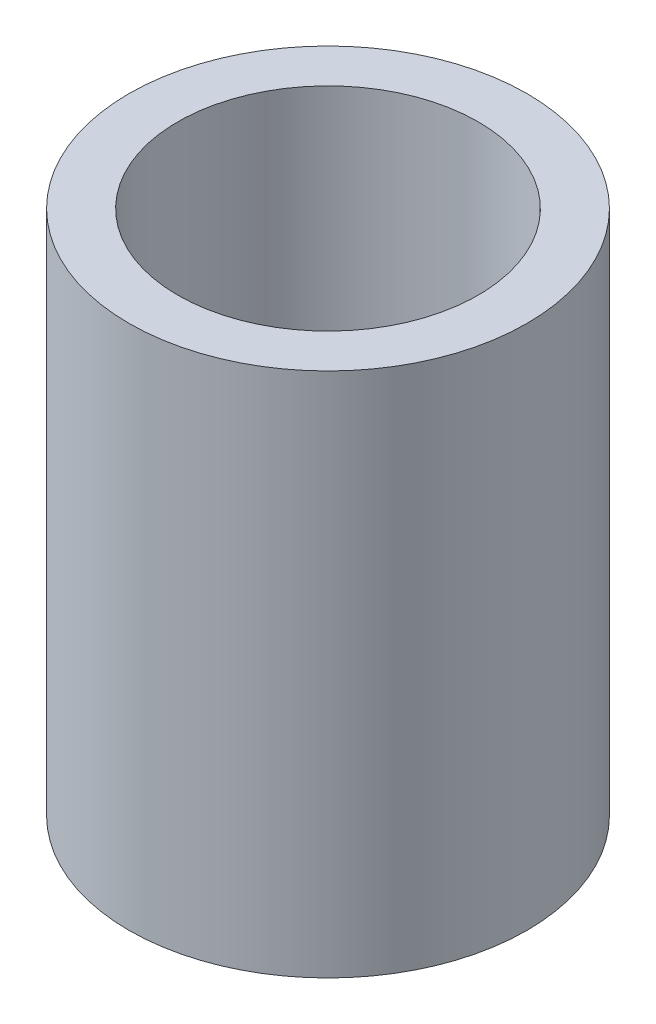
ISO-10303-21;
HEADER;
FILE_DESCRIPTION(('STEP AP214'),'2;1');
FILE_NAME('part.step','',(''),(''),'','','');
FILE_SCHEMA(('AUTOMOTIVE_DESIGN { 1 0 10303 214 1 1 1 1 }'));
ENDSEC;
DATA;
#1=APPLICATION_CONTEXT('core data for automotive mechanical design processes');
#2=APPLICATION_PROTOCOL_DEFINITION('international standard','automotive_design',2000,#1);
#3=PRODUCT_CONTEXT('',#1,'mechanical');
#4=PRODUCT('Part','Part','',(#3));
#5=PRODUCT_RELATED_PRODUCT_CATEGORY('part','',(#4));
#6=PRODUCT_DEFINITION_FORMATION('','',#4);
#7=PRODUCT_DEFINITION_CONTEXT('part definition',#1,'design');
#8=PRODUCT_DEFINITION('design','',#6,#7);
#9=PRODUCT_DEFINITION_SHAPE('','',#8);
#10=(LENGTH_UNIT() NAMED_UNIT(*) SI_UNIT(.MILLI.,.METRE.));
#11=(NAMED_UNIT(*) PLANE_ANGLE_UNIT() SI_UNIT($,.RADIAN.));
#12=(NAMED_UNIT(*) SI_UNIT($,.STERADIAN.) SOLID_ANGLE_UNIT());
#13=UNCERTAINTY_MEASURE_WITH_UNIT(LENGTH_MEASURE(1.E-05),#10,'distance_accuracy_value','');
#14=(GEOMETRIC_REPRESENTATION_CONTEXT(3) GLOBAL_UNCERTAINTY_ASSIGNED_CONTEXT((#13)) GLOBAL_UNIT_ASSIGNED_CONTEXT((#10,
#11,#12)) REPRESENTATION_CONTEXT('',''));
#15=CARTESIAN_POINT('',(0.,0.,0.));
#16=DIRECTION('',(0.,0.,1.));
#17=DIRECTION('',(1.,0.,0.));
#18=AXIS2_PLACEMENT_3D('',#15,#16,#17);
#19=CARTESIAN_POINT('',(0.,35.,0.));
#20=DIRECTION('',(0.,-1.,0.));
#21=DIRECTION('',(0.,0.,-1.));
#22=AXIS2_PLACEMENT_3D('',#19,#20,#21);
#23=CYLINDRICAL_SURFACE('',#22,13.25);
#24=CARTESIAN_POINT('',(0.,35.,0.));
#25=DIRECTION('',(0.,1.,0.));
#26=DIRECTION('',(0.,0.,1.));
#27=AXIS2_PLACEMENT_3D('',#24,#25,#26);
#28=CIRCLE('',#27,13.25);
#29=CARTESIAN_POINT('',(0.,35.,13.25));
#30=VERTEX_POINT('',#29);
#31=EDGE_CURVE('E10',#30,#30,#28,.T.);
#32=ORIENTED_EDGE('',*,*,#31,.F.);
#33=EDGE_LOOP('',(#32));
#34=FACE_BOUND('',#33,.T.);
#35=CARTESIAN_POINT('',(0.,0.,0.));
#36=DIRECTION('',(0.,1.,0.));
#37=DIRECTION('',(0.,0.,1.));
#38=AXIS2_PLACEMENT_3D('',#35,#36,#37);
#39=CIRCLE('',#38,13.25);
#40=CARTESIAN_POINT('',(0.,0.,13.25));
#41=VERTEX_POINT('',#40);
#42=EDGE_CURVE('E44',#41,#41,#39,.T.);
#43=ORIENTED_EDGE('',*,*,#42,.T.);
#44=EDGE_LOOP('',(#43));
#45=FACE_BOUND('',#44,.T.);
#46=ADVANCED_FACE('F41',(#34,#45),#23,.T.);
#47=CARTESIAN_POINT('',(0.,35.,0.));
#48=DIRECTION('',(0.,1.,0.));
#49=DIRECTION('',(0.,0.,1.));
#50=AXIS2_PLACEMENT_3D('',#47,#48,#49);
#51=PLANE('',#50);
#52=CARTESIAN_POINT('',(0.,35.,0.));
#53=DIRECTION('',(0.,1.,0.));
#54=DIRECTION('',(0.,0.,1.));
#55=AXIS2_PLACEMENT_3D('',#52,#53,#54);
#56=CIRCLE('',#55,10.);
#57=CARTESIAN_POINT('',(0.,35.,10.));
#58=VERTEX_POINT('',#57);
#59=EDGE_CURVE('E79',#58,#58,#56,.T.);
#60=ORIENTED_EDGE('',*,*,#59,.F.);
#61=EDGE_LOOP('',(#60));
#62=FACE_BOUND('',#61,.T.);
#63=ORIENTED_EDGE('',*,*,#31,.T.);
#64=EDGE_LOOP('',(#63));
#65=FACE_BOUND('',#64,.T.);
#66=ADVANCED_FACE('F96',(#62,#65),#51,.T.);
#67=CARTESIAN_POINT('',(0.,0.,0.));
#68=DIRECTION('',(0.,1.,0.));
#69=DIRECTION('',(0.,0.,1.));
#70=AXIS2_PLACEMENT_3D('',#67,#68,#69);
#71=PLANE('',#70);
#72=CARTESIAN_POINT('',(0.,0.,0.));
#73=DIRECTION('',(0.,-1.,0.));
#74=DIRECTION('',(0.,0.,-1.));
#75=AXIS2_PLACEMENT_3D('',#72,#73,#74);
#76=CIRCLE('',#75,10.);
#77=CARTESIAN_POINT('',(0.,0.,-10.));
#78=VERTEX_POINT('',#77);
#79=EDGE_CURVE('E55',#78,#78,#76,.T.);
#80=ORIENTED_EDGE('',*,*,#79,.F.);
#81=EDGE_LOOP('',(#80));
#82=FACE_BOUND('',#81,.T.);
#83=ORIENTED_EDGE('',*,*,#42,.F.);
#84=EDGE_LOOP('',(#83));
#85=FACE_BOUND('',#84,.T.);
#86=ADVANCED_FACE('F98',(#82,#85),#71,.F.);
#87=CARTESIAN_POINT('',(0.,8.,0.));
#88=DIRECTION('',(0.,-1.,0.));
#89=DIRECTION('',(0.,0.,-1.));
#90=AXIS2_PLACEMENT_3D('',#87,#88,#89);
#91=CYLINDRICAL_SURFACE('',#90,10.);
#92=CARTESIAN_POINT('',(0.,8.,0.));
#93=DIRECTION('',(0.,-1.,0.));
#94=DIRECTION('',(0.,0.,-1.));
#95=AXIS2_PLACEMENT_3D('',#92,#93,#94);
#96=CIRCLE('',#95,10.);
#97=CARTESIAN_POINT('',(0.,8.,-10.));
#98=VERTEX_POINT('',#97);
#99=EDGE_CURVE('E53',#98,#98,#96,.T.);
#100=ORIENTED_EDGE('',*,*,#99,.F.);
#101=EDGE_LOOP('',(#100));
#102=FACE_BOUND('',#101,.T.);
#103=ORIENTED_EDGE('',*,*,#79,.T.);
#104=EDGE_LOOP('',(#103));
#105=FACE_BOUND('',#104,.T.);
#106=ADVANCED_FACE('F104',(#102,#105),#91,.F.);
#107=CARTESIAN_POINT('',(0.,8.,0.));
#108=DIRECTION('',(0.,-1.,0.));
#109=DIRECTION('',(0.,0.,-1.));
#110=AXIS2_PLACEMENT_3D('',#107,#108,#109);
#111=PLANE('',#110);
#112=CARTESIAN_POINT('',(0.,8.,0.));
#113=DIRECTION('',(0.,-1.,0.));
#114=DIRECTION('',(0.,0.,-1.));
#115=AXIS2_PLACEMENT_3D('',#112,#113,#114);
#116=CIRCLE('',#115,3.48500000000002);
#117=CARTESIAN_POINT('',(0.,8.,-3.48500000000002));
#118=VERTEX_POINT('',#117);
#119=EDGE_CURVE('E63',#118,#118,#116,.T.);
#120=ORIENTED_EDGE('',*,*,#119,.F.);
#121=EDGE_LOOP('',(#120));
#122=FACE_BOUND('',#121,.T.);
#123=ORIENTED_EDGE('',*,*,#99,.T.);
#124=EDGE_LOOP('',(#123));
#125=FACE_BOUND('',#124,.T.);
#126=ADVANCED_FACE('F110',(#122,#125),#111,.T.);
#127=CARTESIAN_POINT('',(0.,4.,0.));
#128=DIRECTION('',(0.,1.,0.));
#129=DIRECTION('',(0.,0.,1.));
#130=AXIS2_PLACEMENT_3D('',#127,#128,#129);
#131=CYLINDRICAL_SURFACE('',#130,3.48500000000002);
#132=CARTESIAN_POINT('',(0.,4.,0.));
#133=DIRECTION('',(0.,-1.,0.));
#134=DIRECTION('',(0.,0.,-1.));
#135=AXIS2_PLACEMENT_3D('',#132,#133,#134);
#136=CIRCLE('',#135,3.48500000000002);
#137=CARTESIAN_POINT('',(0.,4.,-3.48500000000002));
#138=VERTEX_POINT('',#137);
#139=EDGE_CURVE('E59',#138,#138,#136,.T.);
#140=ORIENTED_EDGE('',*,*,#139,.F.);
#141=EDGE_LOOP('',(#140));
#142=FACE_BOUND('',#141,.T.);
#143=ORIENTED_EDGE('',*,*,#119,.T.);
#144=EDGE_LOOP('',(#143));
#145=FACE_BOUND('',#144,.T.);
#146=ADVANCED_FACE('F114',(#142,#145),#131,.T.);
#147=CARTESIAN_POINT('',(0.,4.,0.));
#148=DIRECTION('',(0.,-1.,0.));
#149=DIRECTION('',(0.,0.,-1.));
#150=AXIS2_PLACEMENT_3D('',#147,#148,#149);
#151=PLANE('',#150);
#152=CARTESIAN_POINT('',(0.,4.,0.));
#153=DIRECTION('',(0.,-1.,0.));
#154=DIRECTION('',(0.,0.,-1.));
#155=AXIS2_PLACEMENT_3D('',#152,#153,#154);
#156=CIRCLE('',#155,1.625);
#157=CARTESIAN_POINT('',(0.,4.,-1.625));
#158=VERTEX_POINT('',#157);
#159=EDGE_CURVE('E71',#158,#158,#156,.T.);
#160=ORIENTED_EDGE('',*,*,#159,.F.);
#161=EDGE_LOOP('',(#160));
#162=FACE_BOUND('',#161,.T.);
#163=ORIENTED_EDGE('',*,*,#139,.T.);
#164=EDGE_LOOP('',(#163));
#165=FACE_BOUND('',#164,.T.);
#166=ADVANCED_FACE('F118',(#162,#165),#151,.T.);
#167=CARTESIAN_POINT('',(0.,12.75,0.));
#168=DIRECTION('',(0.,-1.,0.));
#169=DIRECTION('',(0.,0.,-1.));
#170=AXIS2_PLACEMENT_3D('',#167,#168,#169);
#171=CYLINDRICAL_SURFACE('',#170,1.625);
#172=CARTESIAN_POINT('',(0.,12.75,0.));
#173=DIRECTION('',(0.,-1.,0.));
#174=DIRECTION('',(0.,0.,-1.));
#175=AXIS2_PLACEMENT_3D('',#172,#173,#174);
#176=CIRCLE('',#175,1.625);
#177=CARTESIAN_POINT('',(0.,12.75,-1.625));
#178=VERTEX_POINT('',#177);
#179=EDGE_CURVE('E67',#178,#178,#176,.T.);
#180=ORIENTED_EDGE('',*,*,#179,.F.);
#181=EDGE_LOOP('',(#180));
#182=FACE_BOUND('',#181,.T.);
#183=ORIENTED_EDGE('',*,*,#159,.T.);
#184=EDGE_LOOP('',(#183));
#185=FACE_BOUND('',#184,.T.);
#186=ADVANCED_FACE('F122',(#182,#185),#171,.F.);
#187=CARTESIAN_POINT('',(0.,12.75,0.));
#188=DIRECTION('',(0.,-1.,0.));
#189=DIRECTION('',(0.,0.,-1.));
#190=AXIS2_PLACEMENT_3D('',#187,#188,#189);
#191=PLANE('',#190);
#192=ORIENTED_EDGE('',*,*,#179,.T.);
#193=EDGE_LOOP('',(#192));
#194=FACE_BOUND('',#193,.T.);
#195=ADVANCED_FACE('F92',(#194),#191,.T.);
#196=CARTESIAN_POINT('',(0.,17.,0.));
#197=DIRECTION('',(0.,1.,0.));
#198=DIRECTION('',(0.,0.,1.));
#199=AXIS2_PLACEMENT_3D('',#196,#197,#198);
#200=CYLINDRICAL_SURFACE('',#199,10.);
#201=CARTESIAN_POINT('',(0.,17.,0.));
#202=DIRECTION('',(0.,1.,0.));
#203=DIRECTION('',(0.,0.,1.));
#204=AXIS2_PLACEMENT_3D('',#201,#202,#203);
#205=CIRCLE('',#204,10.);
#206=CARTESIAN_POINT('',(0.,17.,10.));
#207=VERTEX_POINT('',#206);
#208=EDGE_CURVE('E75',#207,#207,#205,.T.);
#209=ORIENTED_EDGE('',*,*,#208,.F.);
#210=EDGE_LOOP('',(#209));
#211=FACE_BOUND('',#210,.T.);
#212=ORIENTED_EDGE('',*,*,#59,.T.);
#213=EDGE_LOOP('',(#212));
#214=FACE_BOUND('',#213,.T.);
#215=ADVANCED_FACE('F89',(#211,#214),#200,.F.);
#216=CARTESIAN_POINT('',(0.,17.,0.));
#217=DIRECTION('',(0.,1.,0.));
#218=DIRECTION('',(0.,0.,1.));
#219=AXIS2_PLACEMENT_3D('',#216,#217,#218);
#220=PLANE('',#219);
#221=ORIENTED_EDGE('',*,*,#208,.T.);
#222=EDGE_LOOP('',(#221));
#223=FACE_BOUND('',#222,.T.);
#224=ADVANCED_FACE('F87',(#223),#220,.T.);
#225=CLOSED_SHELL('',(#46,#66,#86,#106,#126,#146,#166,#186,#195,#215,#224));
#226=MANIFOLD_SOLID_BREP('B2',#225);
#227=ADVANCED_BREP_SHAPE_REPRESENTATION('',(#18,#226),#14);
#228=SHAPE_DEFINITION_REPRESENTATION(#9,#227);
ENDSEC;
END-ISO-10303-21;
